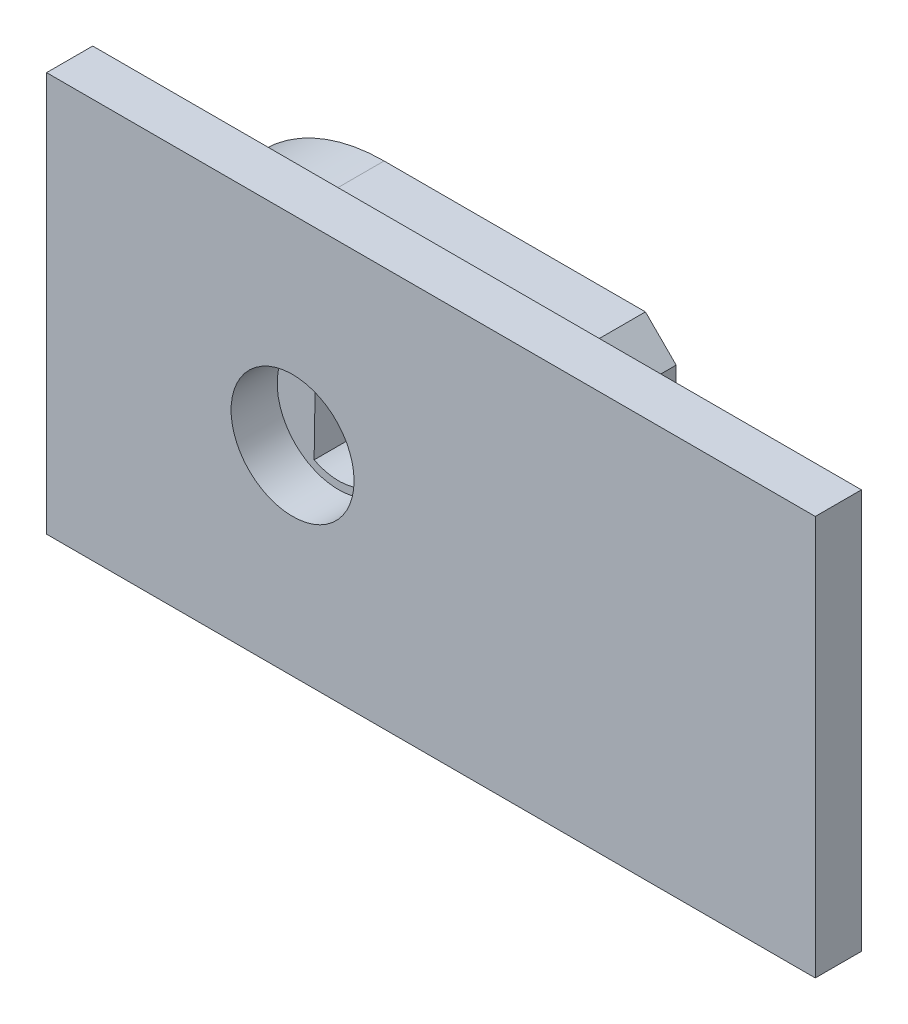
ISO-10303-21;
HEADER;
FILE_DESCRIPTION(('STEP AP214'),'2;1');
FILE_NAME('part.step','',(''),(''),'','','');
FILE_SCHEMA(('AUTOMOTIVE_DESIGN { 1 0 10303 214 1 1 1 1 }'));
ENDSEC;
DATA;
#1=APPLICATION_CONTEXT('core data for automotive mechanical design processes');
#2=APPLICATION_PROTOCOL_DEFINITION('international standard','automotive_design',2000,#1);
#3=PRODUCT_CONTEXT('',#1,'mechanical');
#4=PRODUCT('Part','Part','',(#3));
#5=PRODUCT_RELATED_PRODUCT_CATEGORY('part','',(#4));
#6=PRODUCT_DEFINITION_FORMATION('','',#4);
#7=PRODUCT_DEFINITION_CONTEXT('part definition',#1,'design');
#8=PRODUCT_DEFINITION('design','',#6,#7);
#9=PRODUCT_DEFINITION_SHAPE('','',#8);
#10=(LENGTH_UNIT() NAMED_UNIT(*) SI_UNIT(.MILLI.,.METRE.));
#11=(NAMED_UNIT(*) PLANE_ANGLE_UNIT() SI_UNIT($,.RADIAN.));
#12=(NAMED_UNIT(*) SI_UNIT($,.STERADIAN.) SOLID_ANGLE_UNIT());
#13=UNCERTAINTY_MEASURE_WITH_UNIT(LENGTH_MEASURE(1.E-05),#10,'distance_accuracy_value','');
#14=(GEOMETRIC_REPRESENTATION_CONTEXT(3) GLOBAL_UNCERTAINTY_ASSIGNED_CONTEXT((#13)) GLOBAL_UNIT_ASSIGNED_CONTEXT((#10,
#11,#12)) REPRESENTATION_CONTEXT('',''));
#15=CARTESIAN_POINT('',(0.,0.,0.));
#16=DIRECTION('',(0.,0.,1.));
#17=DIRECTION('',(1.,0.,0.));
#18=AXIS2_PLACEMENT_3D('',#15,#16,#17);
#19=CARTESIAN_POINT('',(0.,0.,0.));
#20=DIRECTION('',(0.,0.,1.));
#21=DIRECTION('',(1.,0.,0.));
#22=AXIS2_PLACEMENT_3D('',#19,#20,#21);
#23=PLANE('',#22);
#24=DIRECTION('',(0.,-1.,0.));
#25=VECTOR('',#24,1.);
#26=CARTESIAN_POINT('',(0.,13.,0.));
#27=LINE('',#26,#25);
#28=CARTESIAN_POINT('',(0.,13.,0.));
#29=VERTEX_POINT('',#28);
#30=CARTESIAN_POINT('',(0.,0.,0.));
#31=VERTEX_POINT('',#30);
#32=EDGE_CURVE('E185',#29,#31,#27,.T.);
#33=ORIENTED_EDGE('',*,*,#32,.F.);
#34=DIRECTION('',(-1.,0.,0.));
#35=VECTOR('',#34,1.);
#36=CARTESIAN_POINT('',(25.,13.,0.));
#37=LINE('',#36,#35);
#38=CARTESIAN_POINT('',(25.,13.,0.));
#39=VERTEX_POINT('',#38);
#40=EDGE_CURVE('E178',#39,#29,#37,.T.);
#41=ORIENTED_EDGE('',*,*,#40,.F.);
#42=DIRECTION('',(0.,1.,0.));
#43=VECTOR('',#42,1.);
#44=CARTESIAN_POINT('',(25.,0.,0.));
#45=LINE('',#44,#43);
#46=CARTESIAN_POINT('',(25.,0.,0.));
#47=VERTEX_POINT('',#46);
#48=EDGE_CURVE('E190',#47,#39,#45,.T.);
#49=ORIENTED_EDGE('',*,*,#48,.F.);
#50=DIRECTION('',(1.,0.,0.));
#51=VECTOR('',#50,1.);
#52=CARTESIAN_POINT('',(0.,0.,0.));
#53=LINE('',#52,#51);
#54=EDGE_CURVE('E188',#31,#47,#53,.T.);
#55=ORIENTED_EDGE('',*,*,#54,.F.);
#56=EDGE_LOOP('',(#33,#41,#49,#55));
#57=FACE_BOUND('',#56,.T.);
#58=DIRECTION('',(0.,-1.,0.));
#59=VECTOR('',#58,1.);
#60=CARTESIAN_POINT('',(16.4761945020315,0.999999999999998,0.));
#61=LINE('',#60,#59);
#62=CARTESIAN_POINT('',(16.4761945020315,11.,0.));
#63=VERTEX_POINT('',#62);
#64=CARTESIAN_POINT('',(16.4761945020315,2.,0.));
#65=VERTEX_POINT('',#64);
#66=EDGE_CURVE('E156',#63,#65,#61,.T.);
#67=ORIENTED_EDGE('',*,*,#66,.F.);
#68=DIRECTION('',(0.707106781186549,-0.707106781186546,0.));
#69=VECTOR('',#68,1.);
#70=CARTESIAN_POINT('',(13.7380972510157,13.7380972510158,0.));
#71=LINE('',#70,#69);
#72=CARTESIAN_POINT('',(15.4761945020315,12.,0.));
#73=VERTEX_POINT('',#72);
#74=EDGE_CURVE('E11',#63,#73,#71,.F.);
#75=ORIENTED_EDGE('',*,*,#74,.T.);
#76=DIRECTION('',(1.,0.,0.));
#77=VECTOR('',#76,1.);
#78=CARTESIAN_POINT('',(1.47619450203147,12.,0.));
#79=LINE('',#78,#77);
#80=CARTESIAN_POINT('',(6.97619450203147,12.,0.));
#81=VERTEX_POINT('',#80);
#82=EDGE_CURVE('E161',#81,#73,#79,.T.);
#83=ORIENTED_EDGE('',*,*,#82,.F.);
#84=CARTESIAN_POINT('',(6.97619450203147,6.5,0.));
#85=DIRECTION('',(0.,0.,1.));
#86=DIRECTION('',(1.,0.,0.));
#87=AXIS2_PLACEMENT_3D('',#84,#85,#86);
#88=CIRCLE('',#87,5.5);
#89=CARTESIAN_POINT('',(1.47619450203147,6.5,0.));
#90=VERTEX_POINT('',#89);
#91=EDGE_CURVE('E218',#81,#90,#88,.T.);
#92=ORIENTED_EDGE('',*,*,#91,.T.);
#93=CARTESIAN_POINT('',(6.97619450203147,6.5,0.));
#94=DIRECTION('',(0.,0.,1.));
#95=DIRECTION('',(1.,0.,0.));
#96=AXIS2_PLACEMENT_3D('',#93,#94,#95);
#97=CIRCLE('',#96,5.5);
#98=CARTESIAN_POINT('',(6.97619450203147,0.999999999999999,0.));
#99=VERTEX_POINT('',#98);
#100=EDGE_CURVE('E215',#90,#99,#97,.T.);
#101=ORIENTED_EDGE('',*,*,#100,.T.);
#102=DIRECTION('',(-1.,0.,0.));
#103=VECTOR('',#102,1.);
#104=CARTESIAN_POINT('',(1.47619450203147,1.,0.));
#105=LINE('',#104,#103);
#106=CARTESIAN_POINT('',(15.4761945020315,0.999999999999999,0.));
#107=VERTEX_POINT('',#106);
#108=EDGE_CURVE('E168',#107,#99,#105,.T.);
#109=ORIENTED_EDGE('',*,*,#108,.F.);
#110=DIRECTION('',(-0.707106781186546,-0.707106781186549,0.));
#111=VECTOR('',#110,1.);
#112=CARTESIAN_POINT('',(7.23809725101576,-7.23809725101574,0.));
#113=LINE('',#112,#111);
#114=EDGE_CURVE('E44',#107,#65,#113,.F.);
#115=ORIENTED_EDGE('',*,*,#114,.T.);
#116=EDGE_LOOP('',(#67,#75,#83,#92,#101,#109,#115));
#117=FACE_BOUND('',#116,.T.);
#118=ADVANCED_FACE('F35',(#57,#117),#23,.F.);
#119=CARTESIAN_POINT('',(0.,13.,1.5));
#120=DIRECTION('',(1.,0.,0.));
#121=DIRECTION('',(0.,0.,-1.));
#122=AXIS2_PLACEMENT_3D('',#119,#120,#121);
#123=PLANE('',#122);
#124=ORIENTED_EDGE('',*,*,#32,.T.);
#125=DIRECTION('',(0.,0.,-1.));
#126=VECTOR('',#125,1.);
#127=CARTESIAN_POINT('',(0.,0.,1.5));
#128=LINE('',#127,#126);
#129=CARTESIAN_POINT('',(0.,0.,1.5));
#130=VERTEX_POINT('',#129);
#131=EDGE_CURVE('E201',#130,#31,#128,.T.);
#132=ORIENTED_EDGE('',*,*,#131,.F.);
#133=DIRECTION('',(0.,-1.,0.));
#134=VECTOR('',#133,1.);
#135=CARTESIAN_POINT('',(0.,13.,1.5));
#136=LINE('',#135,#134);
#137=CARTESIAN_POINT('',(0.,13.,1.5));
#138=VERTEX_POINT('',#137);
#139=EDGE_CURVE('E174',#138,#130,#136,.T.);
#140=ORIENTED_EDGE('',*,*,#139,.F.);
#141=DIRECTION('',(0.,0.,-1.));
#142=VECTOR('',#141,1.);
#143=CARTESIAN_POINT('',(0.,13.,1.5));
#144=LINE('',#143,#142);
#145=EDGE_CURVE('E184',#138,#29,#144,.T.);
#146=ORIENTED_EDGE('',*,*,#145,.T.);
#147=EDGE_LOOP('',(#124,#132,#140,#146));
#148=FACE_BOUND('',#147,.T.);
#149=ADVANCED_FACE('F267',(#148),#123,.F.);
#150=CARTESIAN_POINT('',(0.,0.,1.5));
#151=DIRECTION('',(0.,1.,0.));
#152=DIRECTION('',(0.,0.,1.));
#153=AXIS2_PLACEMENT_3D('',#150,#151,#152);
#154=PLANE('',#153);
#155=ORIENTED_EDGE('',*,*,#54,.T.);
#156=DIRECTION('',(0.,0.,-1.));
#157=VECTOR('',#156,1.);
#158=CARTESIAN_POINT('',(25.,0.,1.5));
#159=LINE('',#158,#157);
#160=CARTESIAN_POINT('',(25.,0.,1.5));
#161=VERTEX_POINT('',#160);
#162=EDGE_CURVE('E198',#161,#47,#159,.T.);
#163=ORIENTED_EDGE('',*,*,#162,.F.);
#164=DIRECTION('',(1.,0.,0.));
#165=VECTOR('',#164,1.);
#166=CARTESIAN_POINT('',(0.,0.,1.5));
#167=LINE('',#166,#165);
#168=EDGE_CURVE('E177',#130,#161,#167,.T.);
#169=ORIENTED_EDGE('',*,*,#168,.F.);
#170=ORIENTED_EDGE('',*,*,#131,.T.);
#171=EDGE_LOOP('',(#155,#163,#169,#170));
#172=FACE_BOUND('',#171,.T.);
#173=ADVANCED_FACE('F273',(#172),#154,.F.);
#174=CARTESIAN_POINT('',(25.,0.,1.5));
#175=DIRECTION('',(-1.,0.,0.));
#176=DIRECTION('',(0.,0.,1.));
#177=AXIS2_PLACEMENT_3D('',#174,#175,#176);
#178=PLANE('',#177);
#179=ORIENTED_EDGE('',*,*,#48,.T.);
#180=DIRECTION('',(0.,0.,-1.));
#181=VECTOR('',#180,1.);
#182=CARTESIAN_POINT('',(25.,13.,1.5));
#183=LINE('',#182,#181);
#184=CARTESIAN_POINT('',(25.,13.,1.5));
#185=VERTEX_POINT('',#184);
#186=EDGE_CURVE('E195',#185,#39,#183,.T.);
#187=ORIENTED_EDGE('',*,*,#186,.F.);
#188=DIRECTION('',(0.,1.,0.));
#189=VECTOR('',#188,1.);
#190=CARTESIAN_POINT('',(25.,0.,1.5));
#191=LINE('',#190,#189);
#192=EDGE_CURVE('E180',#161,#185,#191,.T.);
#193=ORIENTED_EDGE('',*,*,#192,.F.);
#194=ORIENTED_EDGE('',*,*,#162,.T.);
#195=EDGE_LOOP('',(#179,#187,#193,#194));
#196=FACE_BOUND('',#195,.T.);
#197=ADVANCED_FACE('F284',(#196),#178,.F.);
#198=CARTESIAN_POINT('',(25.,13.,1.5));
#199=DIRECTION('',(0.,-1.,0.));
#200=DIRECTION('',(0.,0.,-1.));
#201=AXIS2_PLACEMENT_3D('',#198,#199,#200);
#202=PLANE('',#201);
#203=ORIENTED_EDGE('',*,*,#40,.T.);
#204=ORIENTED_EDGE('',*,*,#145,.F.);
#205=DIRECTION('',(-1.,0.,0.));
#206=VECTOR('',#205,1.);
#207=CARTESIAN_POINT('',(25.,13.,1.5));
#208=LINE('',#207,#206);
#209=EDGE_CURVE('E182',#185,#138,#208,.T.);
#210=ORIENTED_EDGE('',*,*,#209,.F.);
#211=ORIENTED_EDGE('',*,*,#186,.T.);
#212=EDGE_LOOP('',(#203,#204,#210,#211));
#213=FACE_BOUND('',#212,.T.);
#214=ADVANCED_FACE('F281',(#213),#202,.F.);
#215=CARTESIAN_POINT('',(0.,0.,1.5));
#216=DIRECTION('',(0.,0.,1.));
#217=DIRECTION('',(1.,0.,0.));
#218=AXIS2_PLACEMENT_3D('',#215,#216,#217);
#219=PLANE('',#218);
#220=CARTESIAN_POINT('',(8.,6.5,1.5));
#221=DIRECTION('',(0.,0.,1.));
#222=DIRECTION('',(1.,0.,0.));
#223=AXIS2_PLACEMENT_3D('',#220,#221,#222);
#224=CIRCLE('',#223,2.);
#225=CARTESIAN_POINT('',(10.,6.5,1.5));
#226=VERTEX_POINT('',#225);
#227=EDGE_CURVE('E165',#226,#226,#224,.T.);
#228=ORIENTED_EDGE('',*,*,#227,.F.);
#229=EDGE_LOOP('',(#228));
#230=FACE_BOUND('',#229,.T.);
#231=ORIENTED_EDGE('',*,*,#139,.T.);
#232=ORIENTED_EDGE('',*,*,#168,.T.);
#233=ORIENTED_EDGE('',*,*,#192,.T.);
#234=ORIENTED_EDGE('',*,*,#209,.T.);
#235=EDGE_LOOP('',(#231,#232,#233,#234));
#236=FACE_BOUND('',#235,.T.);
#237=ADVANCED_FACE('F279',(#230,#236),#219,.T.);
#238=CARTESIAN_POINT('',(8.,6.5,-1.3));
#239=DIRECTION('',(0.,0.,1.));
#240=DIRECTION('',(1.,0.,0.));
#241=AXIS2_PLACEMENT_3D('',#238,#239,#240);
#242=CYLINDRICAL_SURFACE('',#241,2.);
#243=ORIENTED_EDGE('',*,*,#227,.T.);
#244=EDGE_LOOP('',(#243));
#245=FACE_BOUND('',#244,.T.);
#246=CARTESIAN_POINT('',(8.,6.5,0.));
#247=DIRECTION('',(0.,0.,1.));
#248=DIRECTION('',(1.,0.,0.));
#249=AXIS2_PLACEMENT_3D('',#246,#247,#248);
#250=CIRCLE('',#249,2.);
#251=CARTESIAN_POINT('',(10.,6.5,0.));
#252=VERTEX_POINT('',#251);
#253=EDGE_CURVE('E173',#252,#252,#250,.T.);
#254=ORIENTED_EDGE('',*,*,#253,.F.);
#255=EDGE_LOOP('',(#254));
#256=FACE_BOUND('',#255,.T.);
#257=ADVANCED_FACE('F314',(#245,#256),#242,.F.);
#258=CARTESIAN_POINT('',(0.,0.,0.));
#259=DIRECTION('',(0.,0.,-1.));
#260=DIRECTION('',(-1.,0.,0.));
#261=AXIS2_PLACEMENT_3D('',#258,#259,#260);
#262=PLANE('',#261);
#263=CARTESIAN_POINT('',(8.,6.5,0.));
#264=DIRECTION('',(0.,0.,-1.));
#265=DIRECTION('',(-1.,0.,0.));
#266=AXIS2_PLACEMENT_3D('',#263,#264,#265);
#267=CIRCLE('',#266,1.75);
#268=CARTESIAN_POINT('',(7.25,8.08113883008419,0.));
#269=VERTEX_POINT('',#268);
#270=CARTESIAN_POINT('',(7.20063577291269,4.94323513899719,0.));
#271=VERTEX_POINT('',#270);
#272=EDGE_CURVE('E146',#269,#271,#267,.T.);
#273=ORIENTED_EDGE('',*,*,#272,.T.);
#274=DIRECTION('',(0.0157296477760898,0.999876281437279,0.));
#275=VECTOR('',#274,1.);
#276=CARTESIAN_POINT('',(7.25,8.08113883008419,0.));
#277=LINE('',#276,#275);
#278=EDGE_CURVE('E149',#271,#269,#277,.T.);
#279=ORIENTED_EDGE('',*,*,#278,.T.);
#280=EDGE_LOOP('',(#273,#279));
#281=FACE_BOUND('',#280,.T.);
#282=ORIENTED_EDGE('',*,*,#253,.T.);
#283=EDGE_LOOP('',(#282));
#284=FACE_BOUND('',#283,.T.);
#285=ADVANCED_FACE('F311',(#281,#284),#262,.F.);
#286=CARTESIAN_POINT('',(0.,0.,-2.5));
#287=DIRECTION('',(0.,0.,-1.));
#288=DIRECTION('',(-1.,0.,0.));
#289=AXIS2_PLACEMENT_3D('',#286,#287,#288);
#290=PLANE('',#289);
#291=DIRECTION('',(0.,-1.,0.));
#292=VECTOR('',#291,1.);
#293=CARTESIAN_POINT('',(16.4761945020315,0.999999999999998,-2.5));
#294=LINE('',#293,#292);
#295=CARTESIAN_POINT('',(16.4761945020315,11.,-2.5));
#296=VERTEX_POINT('',#295);
#297=CARTESIAN_POINT('',(16.4761945020315,2.,-2.5));
#298=VERTEX_POINT('',#297);
#299=EDGE_CURVE('E157',#296,#298,#294,.T.);
#300=ORIENTED_EDGE('',*,*,#299,.T.);
#301=DIRECTION('',(0.707106781186546,0.707106781186549,0.));
#302=VECTOR('',#301,1.);
#303=CARTESIAN_POINT('',(7.23809725101576,-7.23809725101574,-2.5));
#304=LINE('',#303,#302);
#305=CARTESIAN_POINT('',(15.4761945020315,0.999999999999999,-2.5));
#306=VERTEX_POINT('',#305);
#307=EDGE_CURVE('E232',#298,#306,#304,.F.);
#308=ORIENTED_EDGE('',*,*,#307,.T.);
#309=DIRECTION('',(-1.,0.,0.));
#310=VECTOR('',#309,1.);
#311=CARTESIAN_POINT('',(1.47619450203147,1.,-2.5));
#312=LINE('',#311,#310);
#313=CARTESIAN_POINT('',(6.97619450203147,0.999999999999999,-2.5));
#314=VERTEX_POINT('',#313);
#315=EDGE_CURVE('E160',#306,#314,#312,.T.);
#316=ORIENTED_EDGE('',*,*,#315,.T.);
#317=CARTESIAN_POINT('',(6.97619450203147,6.5,-2.5));
#318=DIRECTION('',(0.,0.,-1.));
#319=DIRECTION('',(-1.,0.,0.));
#320=AXIS2_PLACEMENT_3D('',#317,#318,#319);
#321=CIRCLE('',#320,5.5);
#322=CARTESIAN_POINT('',(1.47619450203147,6.5,-2.5));
#323=VERTEX_POINT('',#322);
#324=EDGE_CURVE('E211',#314,#323,#321,.T.);
#325=ORIENTED_EDGE('',*,*,#324,.T.);
#326=CARTESIAN_POINT('',(6.97619450203147,6.5,-2.5));
#327=DIRECTION('',(0.,0.,-1.));
#328=DIRECTION('',(-1.,0.,0.));
#329=AXIS2_PLACEMENT_3D('',#326,#327,#328);
#330=CIRCLE('',#329,5.5);
#331=CARTESIAN_POINT('',(6.97619450203147,12.,-2.5));
#332=VERTEX_POINT('',#331);
#333=EDGE_CURVE('E209',#323,#332,#330,.T.);
#334=ORIENTED_EDGE('',*,*,#333,.T.);
#335=DIRECTION('',(1.,0.,0.));
#336=VECTOR('',#335,1.);
#337=CARTESIAN_POINT('',(1.47619450203147,12.,-2.5));
#338=LINE('',#337,#336);
#339=CARTESIAN_POINT('',(15.4761945020315,12.,-2.5));
#340=VERTEX_POINT('',#339);
#341=EDGE_CURVE('E163',#332,#340,#338,.T.);
#342=ORIENTED_EDGE('',*,*,#341,.T.);
#343=DIRECTION('',(-0.707106781186549,0.707106781186546,0.));
#344=VECTOR('',#343,1.);
#345=CARTESIAN_POINT('',(13.7380972510157,13.7380972510158,-2.5));
#346=LINE('',#345,#344);
#347=EDGE_CURVE('E230',#340,#296,#346,.F.);
#348=ORIENTED_EDGE('',*,*,#347,.T.);
#349=EDGE_LOOP('',(#300,#308,#316,#325,#334,#342,#348));
#350=FACE_BOUND('',#349,.T.);
#351=DIRECTION('',(0.0157296477760898,0.999876281437279,0.));
#352=VECTOR('',#351,1.);
#353=CARTESIAN_POINT('',(7.25,8.08113883008419,-2.5));
#354=LINE('',#353,#352);
#355=CARTESIAN_POINT('',(7.20063577291269,4.94323513899719,-2.5));
#356=VERTEX_POINT('',#355);
#357=CARTESIAN_POINT('',(7.25,8.08113883008419,-2.5));
#358=VERTEX_POINT('',#357);
#359=EDGE_CURVE('E131',#356,#358,#354,.T.);
#360=ORIENTED_EDGE('',*,*,#359,.F.);
#361=CARTESIAN_POINT('',(8.,6.5,-2.5));
#362=DIRECTION('',(0.,0.,-1.));
#363=DIRECTION('',(-1.,0.,0.));
#364=AXIS2_PLACEMENT_3D('',#361,#362,#363);
#365=CIRCLE('',#364,1.75);
#366=EDGE_CURVE('E141',#358,#356,#365,.T.);
#367=ORIENTED_EDGE('',*,*,#366,.F.);
#368=EDGE_LOOP('',(#360,#367));
#369=FACE_BOUND('',#368,.T.);
#370=ADVANCED_FACE('F148',(#350,#369),#290,.T.);
#371=CARTESIAN_POINT('',(16.4761945020315,0.999999999999998,-2.5));
#372=DIRECTION('',(-1.,0.,0.));
#373=DIRECTION('',(0.,0.,1.));
#374=AXIS2_PLACEMENT_3D('',#371,#372,#373);
#375=PLANE('',#374);
#376=ORIENTED_EDGE('',*,*,#66,.T.);
#377=DIRECTION('',(0.,0.,-1.));
#378=VECTOR('',#377,1.);
#379=CARTESIAN_POINT('',(16.4761945020315,2.,-2.5));
#380=LINE('',#379,#378);
#381=EDGE_CURVE('E228',#65,#298,#380,.T.);
#382=ORIENTED_EDGE('',*,*,#381,.T.);
#383=ORIENTED_EDGE('',*,*,#299,.F.);
#384=DIRECTION('',(0.,0.,1.));
#385=VECTOR('',#384,1.);
#386=CARTESIAN_POINT('',(16.4761945020315,11.,-2.5));
#387=LINE('',#386,#385);
#388=EDGE_CURVE('E225',#296,#63,#387,.T.);
#389=ORIENTED_EDGE('',*,*,#388,.T.);
#390=EDGE_LOOP('',(#376,#382,#383,#389));
#391=FACE_BOUND('',#390,.T.);
#392=ADVANCED_FACE('F239',(#391),#375,.F.);
#393=CARTESIAN_POINT('',(1.47619450203147,1.,-2.5));
#394=DIRECTION('',(0.,1.,0.));
#395=DIRECTION('',(-1.,0.,0.));
#396=AXIS2_PLACEMENT_3D('',#393,#394,#395);
#397=PLANE('',#396);
#398=ORIENTED_EDGE('',*,*,#315,.F.);
#399=DIRECTION('',(0.,0.,1.));
#400=VECTOR('',#399,1.);
#401=CARTESIAN_POINT('',(15.4761945020315,0.999999999999999,-2.5));
#402=LINE('',#401,#400);
#403=EDGE_CURVE('E220',#306,#107,#402,.T.);
#404=ORIENTED_EDGE('',*,*,#403,.T.);
#405=ORIENTED_EDGE('',*,*,#108,.T.);
#406=DIRECTION('',(0.,0.,1.));
#407=VECTOR('',#406,1.);
#408=CARTESIAN_POINT('',(6.97619450203147,0.999999999999999,-2.5));
#409=LINE('',#408,#407);
#410=EDGE_CURVE('E204',#99,#314,#409,.F.);
#411=ORIENTED_EDGE('',*,*,#410,.T.);
#412=EDGE_LOOP('',(#398,#404,#405,#411));
#413=FACE_BOUND('',#412,.T.);
#414=ADVANCED_FACE('F248',(#413),#397,.F.);
#415=CARTESIAN_POINT('',(1.47619450203147,12.,-2.5));
#416=DIRECTION('',(0.,-1.,0.));
#417=DIRECTION('',(0.,0.,-1.));
#418=AXIS2_PLACEMENT_3D('',#415,#416,#417);
#419=PLANE('',#418);
#420=ORIENTED_EDGE('',*,*,#82,.T.);
#421=DIRECTION('',(0.,0.,-1.));
#422=VECTOR('',#421,1.);
#423=CARTESIAN_POINT('',(15.4761945020315,12.,-2.5));
#424=LINE('',#423,#422);
#425=EDGE_CURVE('E56',#73,#340,#424,.T.);
#426=ORIENTED_EDGE('',*,*,#425,.T.);
#427=ORIENTED_EDGE('',*,*,#341,.F.);
#428=DIRECTION('',(0.,0.,1.));
#429=VECTOR('',#428,1.);
#430=CARTESIAN_POINT('',(6.97619450203147,12.,-2.5));
#431=LINE('',#430,#429);
#432=EDGE_CURVE('E213',#332,#81,#431,.T.);
#433=ORIENTED_EDGE('',*,*,#432,.T.);
#434=EDGE_LOOP('',(#420,#426,#427,#433));
#435=FACE_BOUND('',#434,.T.);
#436=ADVANCED_FACE('F259',(#435),#419,.F.);
#437=CARTESIAN_POINT('',(8.,6.5,-2.5));
#438=DIRECTION('',(0.,0.,1.));
#439=DIRECTION('',(1.,0.,0.));
#440=AXIS2_PLACEMENT_3D('',#437,#438,#439);
#441=CYLINDRICAL_SURFACE('',#440,1.75);
#442=ORIENTED_EDGE('',*,*,#272,.F.);
#443=DIRECTION('',(0.,0.,1.));
#444=VECTOR('',#443,1.);
#445=CARTESIAN_POINT('',(7.25,8.08113883008419,-2.5));
#446=LINE('',#445,#444);
#447=EDGE_CURVE('E134',#358,#269,#446,.T.);
#448=ORIENTED_EDGE('',*,*,#447,.F.);
#449=ORIENTED_EDGE('',*,*,#366,.T.);
#450=DIRECTION('',(0.,0.,1.));
#451=VECTOR('',#450,1.);
#452=CARTESIAN_POINT('',(7.20063577291269,4.94323513899719,-2.5));
#453=LINE('',#452,#451);
#454=EDGE_CURVE('E137',#356,#271,#453,.T.);
#455=ORIENTED_EDGE('',*,*,#454,.T.);
#456=EDGE_LOOP('',(#442,#448,#449,#455));
#457=FACE_BOUND('',#456,.T.);
#458=ADVANCED_FACE('F144',(#457),#441,.F.);
#459=CARTESIAN_POINT('',(7.25,8.08113883008419,-2.5));
#460=DIRECTION('',(0.999876281437279,-0.0157296477760898,0.));
#461=DIRECTION('',(0.0157296477760898,0.999876281437279,0.));
#462=AXIS2_PLACEMENT_3D('',#459,#460,#461);
#463=PLANE('',#462);
#464=ORIENTED_EDGE('',*,*,#278,.F.);
#465=ORIENTED_EDGE('',*,*,#454,.F.);
#466=ORIENTED_EDGE('',*,*,#359,.T.);
#467=ORIENTED_EDGE('',*,*,#447,.T.);
#468=EDGE_LOOP('',(#464,#465,#466,#467));
#469=FACE_BOUND('',#468,.T.);
#470=ADVANCED_FACE('F133',(#469),#463,.T.);
#471=CARTESIAN_POINT('',(6.97619450203147,6.5,-2.5));
#472=DIRECTION('',(0.,0.,1.));
#473=DIRECTION('',(1.,0.,0.));
#474=AXIS2_PLACEMENT_3D('',#471,#472,#473);
#475=CYLINDRICAL_SURFACE('',#474,5.5);
#476=ORIENTED_EDGE('',*,*,#432,.F.);
#477=ORIENTED_EDGE('',*,*,#333,.F.);
#478=DIRECTION('',(0.,0.,1.));
#479=VECTOR('',#478,1.);
#480=CARTESIAN_POINT('',(1.47619450203147,6.5,-2.5));
#481=LINE('',#480,#479);
#482=EDGE_CURVE('E153',#90,#323,#481,.F.);
#483=ORIENTED_EDGE('',*,*,#482,.F.);
#484=ORIENTED_EDGE('',*,*,#91,.F.);
#485=EDGE_LOOP('',(#476,#477,#483,#484));
#486=FACE_BOUND('',#485,.T.);
#487=ADVANCED_FACE('F257',(#486),#475,.T.);
#488=CARTESIAN_POINT('',(6.97619450203147,6.5,-2.5));
#489=DIRECTION('',(0.,0.,1.));
#490=DIRECTION('',(1.,0.,0.));
#491=AXIS2_PLACEMENT_3D('',#488,#489,#490);
#492=CYLINDRICAL_SURFACE('',#491,5.5);
#493=ORIENTED_EDGE('',*,*,#324,.F.);
#494=ORIENTED_EDGE('',*,*,#410,.F.);
#495=ORIENTED_EDGE('',*,*,#100,.F.);
#496=ORIENTED_EDGE('',*,*,#482,.T.);
#497=EDGE_LOOP('',(#493,#494,#495,#496));
#498=FACE_BOUND('',#497,.T.);
#499=ADVANCED_FACE('F252',(#498),#492,.T.);
#500=CARTESIAN_POINT('',(15.4761945020315,0.999999999999999,-2.5));
#501=DIRECTION('',(-0.707106781186549,0.707106781186546,0.));
#502=DIRECTION('',(0.,0.,1.));
#503=AXIS2_PLACEMENT_3D('',#500,#501,#502);
#504=PLANE('',#503);
#505=ORIENTED_EDGE('',*,*,#307,.F.);
#506=ORIENTED_EDGE('',*,*,#381,.F.);
#507=ORIENTED_EDGE('',*,*,#114,.F.);
#508=ORIENTED_EDGE('',*,*,#403,.F.);
#509=EDGE_LOOP('',(#505,#506,#507,#508));
#510=FACE_BOUND('',#509,.T.);
#511=ADVANCED_FACE('F243',(#510),#504,.F.);
#512=CARTESIAN_POINT('',(16.4761945020315,11.,-2.5));
#513=DIRECTION('',(-0.707106781186546,-0.707106781186549,0.));
#514=DIRECTION('',(0.,0.,1.));
#515=AXIS2_PLACEMENT_3D('',#512,#513,#514);
#516=PLANE('',#515);
#517=ORIENTED_EDGE('',*,*,#347,.F.);
#518=ORIENTED_EDGE('',*,*,#425,.F.);
#519=ORIENTED_EDGE('',*,*,#74,.F.);
#520=ORIENTED_EDGE('',*,*,#388,.F.);
#521=EDGE_LOOP('',(#517,#518,#519,#520));
#522=FACE_BOUND('',#521,.T.);
#523=ADVANCED_FACE('F38',(#522),#516,.F.);
#524=CLOSED_SHELL('',(#118,#149,#173,#197,#214,#237,#257,#285,#370,#392,#414,#436,#458,#470,
#487,#499,#511,#523));
#525=MANIFOLD_SOLID_BREP('B2',#524);
#526=ADVANCED_BREP_SHAPE_REPRESENTATION('',(#18,#525),#14);
#527=SHAPE_DEFINITION_REPRESENTATION(#9,#526);
ENDSEC;
END-ISO-10303-21;
